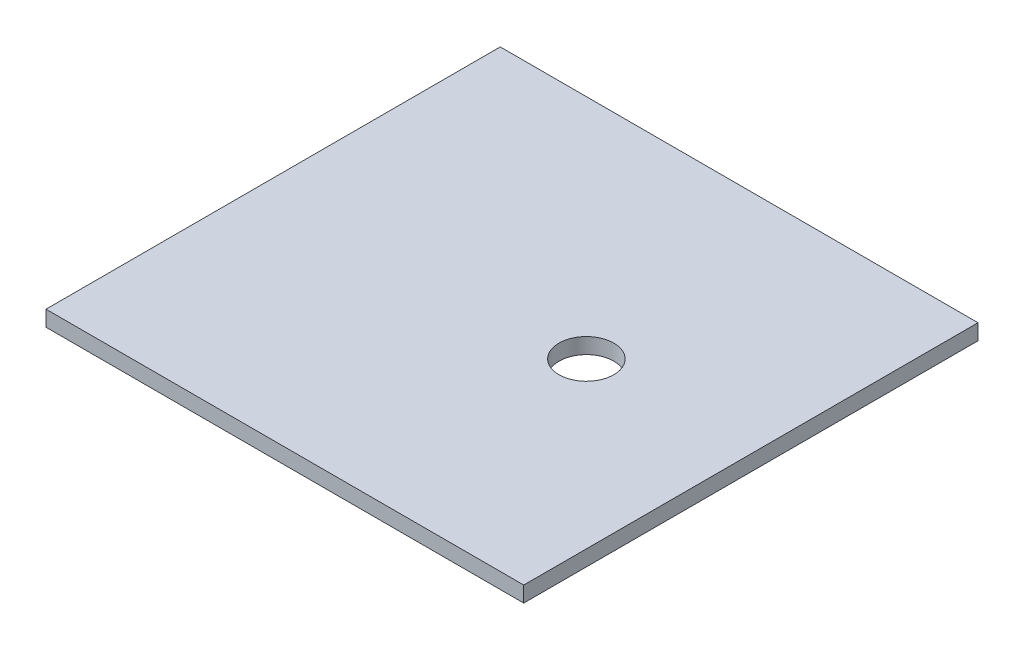
ISO-10303-21;
HEADER;
FILE_DESCRIPTION(('STEP AP214'),'2;1');
FILE_NAME('part.step','',(''),(''),'','','');
FILE_SCHEMA(('AUTOMOTIVE_DESIGN { 1 0 10303 214 1 1 1 1 }'));
ENDSEC;
DATA;
#1=APPLICATION_CONTEXT('core data for automotive mechanical design processes');
#2=APPLICATION_PROTOCOL_DEFINITION('international standard','automotive_design',2000,#1);
#3=PRODUCT_CONTEXT('',#1,'mechanical');
#4=PRODUCT('Part','Part','',(#3));
#5=PRODUCT_RELATED_PRODUCT_CATEGORY('part','',(#4));
#6=PRODUCT_DEFINITION_FORMATION('','',#4);
#7=PRODUCT_DEFINITION_CONTEXT('part definition',#1,'design');
#8=PRODUCT_DEFINITION('design','',#6,#7);
#9=PRODUCT_DEFINITION_SHAPE('','',#8);
#10=(LENGTH_UNIT() NAMED_UNIT(*) SI_UNIT(.MILLI.,.METRE.));
#11=(NAMED_UNIT(*) PLANE_ANGLE_UNIT() SI_UNIT($,.RADIAN.));
#12=(NAMED_UNIT(*) SI_UNIT($,.STERADIAN.) SOLID_ANGLE_UNIT());
#13=UNCERTAINTY_MEASURE_WITH_UNIT(LENGTH_MEASURE(1.E-05),#10,'distance_accuracy_value','');
#14=(GEOMETRIC_REPRESENTATION_CONTEXT(3) GLOBAL_UNCERTAINTY_ASSIGNED_CONTEXT((#13)) GLOBAL_UNIT_ASSIGNED_CONTEXT((#10,
#11,#12)) REPRESENTATION_CONTEXT('',''));
#15=CARTESIAN_POINT('',(0.,0.,0.));
#16=DIRECTION('',(0.,0.,1.));
#17=DIRECTION('',(1.,0.,0.));
#18=AXIS2_PLACEMENT_3D('',#15,#16,#17);
#19=CARTESIAN_POINT('',(0.,10.,0.));
#20=DIRECTION('',(0.,1.,0.));
#21=DIRECTION('',(0.,0.,1.));
#22=AXIS2_PLACEMENT_3D('',#19,#20,#21);
#23=PLANE('',#22);
#24=DIRECTION('',(0.,0.,1.));
#25=VECTOR('',#24,1.);
#26=CARTESIAN_POINT('',(-175.,10.,-145.));
#27=LINE('',#26,#25);
#28=CARTESIAN_POINT('',(-175.,10.,-145.));
#29=VERTEX_POINT('',#28);
#30=CARTESIAN_POINT('',(-175.,10.,145.));
#31=VERTEX_POINT('',#30);
#32=EDGE_CURVE('E85',#29,#31,#27,.T.);
#33=ORIENTED_EDGE('',*,*,#32,.T.);
#34=DIRECTION('',(1.,0.,0.));
#35=VECTOR('',#34,1.);
#36=CARTESIAN_POINT('',(-175.,10.,145.));
#37=LINE('',#36,#35);
#38=CARTESIAN_POINT('',(130.,10.,145.));
#39=VERTEX_POINT('',#38);
#40=EDGE_CURVE('E80',#31,#39,#37,.T.);
#41=ORIENTED_EDGE('',*,*,#40,.T.);
#42=DIRECTION('',(0.,0.,-1.));
#43=VECTOR('',#42,1.);
#44=CARTESIAN_POINT('',(130.,10.,-145.));
#45=LINE('',#44,#43);
#46=CARTESIAN_POINT('',(130.,10.,-145.));
#47=VERTEX_POINT('',#46);
#48=EDGE_CURVE('E83',#39,#47,#45,.T.);
#49=ORIENTED_EDGE('',*,*,#48,.T.);
#50=DIRECTION('',(-1.,0.,0.));
#51=VECTOR('',#50,1.);
#52=CARTESIAN_POINT('',(-175.,10.,-145.));
#53=LINE('',#52,#51);
#54=EDGE_CURVE('E50',#47,#29,#53,.T.);
#55=ORIENTED_EDGE('',*,*,#54,.T.);
#56=EDGE_LOOP('',(#33,#41,#49,#55));
#57=FACE_BOUND('',#56,.T.);
#58=CARTESIAN_POINT('',(25.0000000000001,10.,0.));
#59=DIRECTION('',(0.,1.,0.));
#60=DIRECTION('',(0.,0.,1.));
#61=AXIS2_PLACEMENT_3D('',#58,#59,#60);
#62=CIRCLE('',#61,17.5);
#63=CARTESIAN_POINT('',(25.0000000000001,10.,17.5));
#64=VERTEX_POINT('',#63);
#65=EDGE_CURVE('E100',#64,#64,#62,.T.);
#66=ORIENTED_EDGE('',*,*,#65,.F.);
#67=EDGE_LOOP('',(#66));
#68=FACE_BOUND('',#67,.T.);
#69=ADVANCED_FACE('F33',(#57,#68),#23,.T.);
#70=CARTESIAN_POINT('',(0.,0.,0.));
#71=DIRECTION('',(0.,1.,0.));
#72=DIRECTION('',(0.,0.,1.));
#73=AXIS2_PLACEMENT_3D('',#70,#71,#72);
#74=PLANE('',#73);
#75=DIRECTION('',(0.,0.,1.));
#76=VECTOR('',#75,1.);
#77=CARTESIAN_POINT('',(-175.,0.,-145.));
#78=LINE('',#77,#76);
#79=CARTESIAN_POINT('',(-175.,0.,-145.));
#80=VERTEX_POINT('',#79);
#81=CARTESIAN_POINT('',(-175.,0.,145.));
#82=VERTEX_POINT('',#81);
#83=EDGE_CURVE('E97',#80,#82,#78,.T.);
#84=ORIENTED_EDGE('',*,*,#83,.F.);
#85=DIRECTION('',(-1.,0.,0.));
#86=VECTOR('',#85,1.);
#87=CARTESIAN_POINT('',(-175.,0.,-145.));
#88=LINE('',#87,#86);
#89=CARTESIAN_POINT('',(130.,0.,-145.));
#90=VERTEX_POINT('',#89);
#91=EDGE_CURVE('E73',#90,#80,#88,.T.);
#92=ORIENTED_EDGE('',*,*,#91,.F.);
#93=DIRECTION('',(0.,0.,-1.));
#94=VECTOR('',#93,1.);
#95=CARTESIAN_POINT('',(130.,0.,-145.));
#96=LINE('',#95,#94);
#97=CARTESIAN_POINT('',(130.,0.,145.));
#98=VERTEX_POINT('',#97);
#99=EDGE_CURVE('E67',#98,#90,#96,.T.);
#100=ORIENTED_EDGE('',*,*,#99,.F.);
#101=DIRECTION('',(1.,0.,0.));
#102=VECTOR('',#101,1.);
#103=CARTESIAN_POINT('',(-175.,0.,145.));
#104=LINE('',#103,#102);
#105=EDGE_CURVE('E89',#82,#98,#104,.T.);
#106=ORIENTED_EDGE('',*,*,#105,.F.);
#107=EDGE_LOOP('',(#84,#92,#100,#106));
#108=FACE_BOUND('',#107,.T.);
#109=CARTESIAN_POINT('',(25.0000000000001,0.,0.));
#110=DIRECTION('',(0.,1.,0.));
#111=DIRECTION('',(0.,0.,1.));
#112=AXIS2_PLACEMENT_3D('',#109,#110,#111);
#113=CIRCLE('',#112,17.5);
#114=CARTESIAN_POINT('',(25.0000000000001,0.,17.5));
#115=VERTEX_POINT('',#114);
#116=EDGE_CURVE('E112',#115,#115,#113,.T.);
#117=ORIENTED_EDGE('',*,*,#116,.T.);
#118=EDGE_LOOP('',(#117));
#119=FACE_BOUND('',#118,.T.);
#120=ADVANCED_FACE('F108',(#108,#119),#74,.F.);
#121=CARTESIAN_POINT('',(-175.,10.,-145.));
#122=DIRECTION('',(1.,0.,0.));
#123=DIRECTION('',(0.,0.,-1.));
#124=AXIS2_PLACEMENT_3D('',#121,#122,#123);
#125=PLANE('',#124);
#126=ORIENTED_EDGE('',*,*,#83,.T.);
#127=DIRECTION('',(0.,-1.,0.));
#128=VECTOR('',#127,1.);
#129=CARTESIAN_POINT('',(-175.,10.,145.));
#130=LINE('',#129,#128);
#131=EDGE_CURVE('E11',#31,#82,#130,.T.);
#132=ORIENTED_EDGE('',*,*,#131,.F.);
#133=ORIENTED_EDGE('',*,*,#32,.F.);
#134=DIRECTION('',(0.,-1.,0.));
#135=VECTOR('',#134,1.);
#136=CARTESIAN_POINT('',(-175.,10.,-145.));
#137=LINE('',#136,#135);
#138=EDGE_CURVE('E93',#29,#80,#137,.T.);
#139=ORIENTED_EDGE('',*,*,#138,.T.);
#140=EDGE_LOOP('',(#126,#132,#133,#139));
#141=FACE_BOUND('',#140,.T.);
#142=ADVANCED_FACE('F35',(#141),#125,.F.);
#143=CARTESIAN_POINT('',(-175.,10.,145.));
#144=DIRECTION('',(0.,0.,-1.));
#145=DIRECTION('',(-1.,0.,0.));
#146=AXIS2_PLACEMENT_3D('',#143,#144,#145);
#147=PLANE('',#146);
#148=ORIENTED_EDGE('',*,*,#105,.T.);
#149=DIRECTION('',(0.,-1.,0.));
#150=VECTOR('',#149,1.);
#151=CARTESIAN_POINT('',(130.,10.,145.));
#152=LINE('',#151,#150);
#153=EDGE_CURVE('E42',#39,#98,#152,.T.);
#154=ORIENTED_EDGE('',*,*,#153,.F.);
#155=ORIENTED_EDGE('',*,*,#40,.F.);
#156=ORIENTED_EDGE('',*,*,#131,.T.);
#157=EDGE_LOOP('',(#148,#154,#155,#156));
#158=FACE_BOUND('',#157,.T.);
#159=ADVANCED_FACE('F88',(#158),#147,.F.);
#160=CARTESIAN_POINT('',(130.,10.,-145.));
#161=DIRECTION('',(-1.,0.,0.));
#162=DIRECTION('',(0.,0.,1.));
#163=AXIS2_PLACEMENT_3D('',#160,#161,#162);
#164=PLANE('',#163);
#165=ORIENTED_EDGE('',*,*,#99,.T.);
#166=DIRECTION('',(0.,-1.,0.));
#167=VECTOR('',#166,1.);
#168=CARTESIAN_POINT('',(130.,10.,-145.));
#169=LINE('',#168,#167);
#170=EDGE_CURVE('E90',#47,#90,#169,.T.);
#171=ORIENTED_EDGE('',*,*,#170,.F.);
#172=ORIENTED_EDGE('',*,*,#48,.F.);
#173=ORIENTED_EDGE('',*,*,#153,.T.);
#174=EDGE_LOOP('',(#165,#171,#172,#173));
#175=FACE_BOUND('',#174,.T.);
#176=ADVANCED_FACE('F91',(#175),#164,.F.);
#177=CARTESIAN_POINT('',(-175.,10.,-145.));
#178=DIRECTION('',(0.,0.,1.));
#179=DIRECTION('',(1.,0.,0.));
#180=AXIS2_PLACEMENT_3D('',#177,#178,#179);
#181=PLANE('',#180);
#182=ORIENTED_EDGE('',*,*,#91,.T.);
#183=ORIENTED_EDGE('',*,*,#138,.F.);
#184=ORIENTED_EDGE('',*,*,#54,.F.);
#185=ORIENTED_EDGE('',*,*,#170,.T.);
#186=EDGE_LOOP('',(#182,#183,#184,#185));
#187=FACE_BOUND('',#186,.T.);
#188=ADVANCED_FACE('F105',(#187),#181,.F.);
#189=CARTESIAN_POINT('',(25.0000000000001,10.,0.));
#190=DIRECTION('',(0.,-1.,0.));
#191=DIRECTION('',(0.,0.,-1.));
#192=AXIS2_PLACEMENT_3D('',#189,#190,#191);
#193=CYLINDRICAL_SURFACE('',#192,17.5);
#194=ORIENTED_EDGE('',*,*,#65,.T.);
#195=EDGE_LOOP('',(#194));
#196=FACE_BOUND('',#195,.T.);
#197=ORIENTED_EDGE('',*,*,#116,.F.);
#198=EDGE_LOOP('',(#197));
#199=FACE_BOUND('',#198,.T.);
#200=ADVANCED_FACE('F118',(#196,#199),#193,.F.);
#201=CLOSED_SHELL('',(#69,#120,#142,#159,#176,#188,#200));
#202=MANIFOLD_SOLID_BREP('B2',#201);
#203=ADVANCED_BREP_SHAPE_REPRESENTATION('',(#18,#202),#14);
#204=SHAPE_DEFINITION_REPRESENTATION(#9,#203);
ENDSEC;
END-ISO-10303-21;
